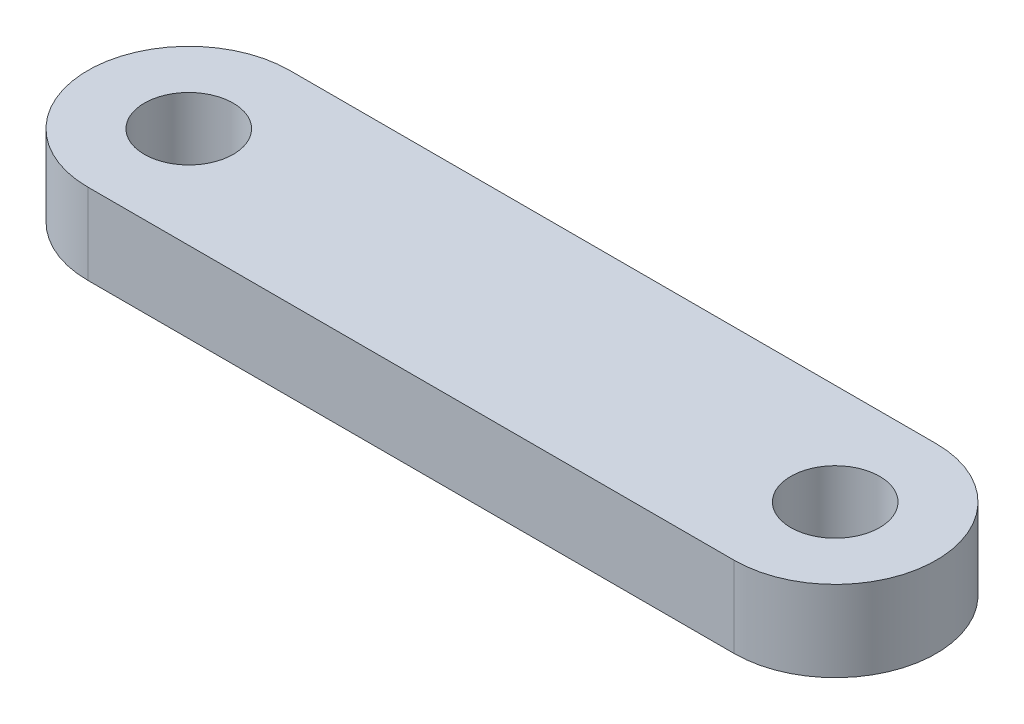
ISO-10303-21;
HEADER;
FILE_DESCRIPTION(('STEP AP214'),'2;1');
FILE_NAME('part.step','',(''),(''),'','','');
FILE_SCHEMA(('AUTOMOTIVE_DESIGN { 1 0 10303 214 1 1 1 1 }'));
ENDSEC;
DATA;
#1=APPLICATION_CONTEXT('core data for automotive mechanical design processes');
#2=APPLICATION_PROTOCOL_DEFINITION('international standard','automotive_design',2000,#1);
#3=PRODUCT_CONTEXT('',#1,'mechanical');
#4=PRODUCT('Part','Part','',(#3));
#5=PRODUCT_RELATED_PRODUCT_CATEGORY('part','',(#4));
#6=PRODUCT_DEFINITION_FORMATION('','',#4);
#7=PRODUCT_DEFINITION_CONTEXT('part definition',#1,'design');
#8=PRODUCT_DEFINITION('design','',#6,#7);
#9=PRODUCT_DEFINITION_SHAPE('','',#8);
#10=(LENGTH_UNIT() NAMED_UNIT(*) SI_UNIT(.MILLI.,.METRE.));
#11=(NAMED_UNIT(*) PLANE_ANGLE_UNIT() SI_UNIT($,.RADIAN.));
#12=(NAMED_UNIT(*) SI_UNIT($,.STERADIAN.) SOLID_ANGLE_UNIT());
#13=UNCERTAINTY_MEASURE_WITH_UNIT(LENGTH_MEASURE(1.E-05),#10,'distance_accuracy_value','');
#14=(GEOMETRIC_REPRESENTATION_CONTEXT(3) GLOBAL_UNCERTAINTY_ASSIGNED_CONTEXT((#13)) GLOBAL_UNIT_ASSIGNED_CONTEXT((#10,
#11,#12)) REPRESENTATION_CONTEXT('',''));
#15=CARTESIAN_POINT('',(0.,0.,0.));
#16=DIRECTION('',(0.,0.,1.));
#17=DIRECTION('',(1.,0.,0.));
#18=AXIS2_PLACEMENT_3D('',#15,#16,#17);
#19=CARTESIAN_POINT('',(0.,2.,0.));
#20=DIRECTION('',(0.,1.,0.));
#21=DIRECTION('',(0.,0.,1.));
#22=AXIS2_PLACEMENT_3D('',#19,#20,#21);
#23=PLANE('',#22);
#24=CARTESIAN_POINT('',(0.,2.,0.));
#25=DIRECTION('',(0.,1.,0.));
#26=DIRECTION('',(0.,0.,1.));
#27=AXIS2_PLACEMENT_3D('',#24,#25,#26);
#28=CIRCLE('',#27,1.1);
#29=CARTESIAN_POINT('',(0.,2.,1.1));
#30=VERTEX_POINT('',#29);
#31=EDGE_CURVE('E116',#30,#30,#28,.T.);
#32=ORIENTED_EDGE('',*,*,#31,.F.);
#33=EDGE_LOOP('',(#32));
#34=FACE_BOUND('',#33,.T.);
#35=CARTESIAN_POINT('',(0.,2.,0.));
#36=DIRECTION('',(0.,1.,0.));
#37=DIRECTION('',(0.,0.,1.));
#38=AXIS2_PLACEMENT_3D('',#35,#36,#37);
#39=CIRCLE('',#38,2.5);
#40=CARTESIAN_POINT('',(0.,2.,-2.5));
#41=VERTEX_POINT('',#40);
#42=CARTESIAN_POINT('',(0.,2.,2.5));
#43=VERTEX_POINT('',#42);
#44=EDGE_CURVE('E96',#41,#43,#39,.T.);
#45=ORIENTED_EDGE('',*,*,#44,.T.);
#46=DIRECTION('',(1.,0.,0.));
#47=VECTOR('',#46,1.);
#48=CARTESIAN_POINT('',(0.,2.,2.5));
#49=LINE('',#48,#47);
#50=CARTESIAN_POINT('',(16.,2.,2.5));
#51=VERTEX_POINT('',#50);
#52=EDGE_CURVE('E91',#43,#51,#49,.T.);
#53=ORIENTED_EDGE('',*,*,#52,.T.);
#54=CARTESIAN_POINT('',(16.,2.,0.));
#55=DIRECTION('',(0.,1.,0.));
#56=DIRECTION('',(0.,0.,1.));
#57=AXIS2_PLACEMENT_3D('',#54,#55,#56);
#58=CIRCLE('',#57,2.5);
#59=CARTESIAN_POINT('',(16.,2.,-2.5));
#60=VERTEX_POINT('',#59);
#61=EDGE_CURVE('E94',#51,#60,#58,.T.);
#62=ORIENTED_EDGE('',*,*,#61,.T.);
#63=DIRECTION('',(-1.,0.,0.));
#64=VECTOR('',#63,1.);
#65=CARTESIAN_POINT('',(0.,2.,-2.5));
#66=LINE('',#65,#64);
#67=EDGE_CURVE('E61',#60,#41,#66,.T.);
#68=ORIENTED_EDGE('',*,*,#67,.T.);
#69=EDGE_LOOP('',(#45,#53,#62,#68));
#70=FACE_BOUND('',#69,.T.);
#71=CARTESIAN_POINT('',(16.,2.,0.));
#72=DIRECTION('',(0.,1.,0.));
#73=DIRECTION('',(0.,0.,1.));
#74=AXIS2_PLACEMENT_3D('',#71,#72,#73);
#75=CIRCLE('',#74,1.1);
#76=CARTESIAN_POINT('',(16.,2.,1.1));
#77=VERTEX_POINT('',#76);
#78=EDGE_CURVE('E138',#77,#77,#75,.T.);
#79=ORIENTED_EDGE('',*,*,#78,.F.);
#80=EDGE_LOOP('',(#79));
#81=FACE_BOUND('',#80,.T.);
#82=ADVANCED_FACE('F43',(#34,#70,#81),#23,.T.);
#83=CARTESIAN_POINT('',(0.,0.,0.));
#84=DIRECTION('',(0.,1.,0.));
#85=DIRECTION('',(0.,0.,1.));
#86=AXIS2_PLACEMENT_3D('',#83,#84,#85);
#87=PLANE('',#86);
#88=CARTESIAN_POINT('',(0.,0.,0.));
#89=DIRECTION('',(0.,1.,0.));
#90=DIRECTION('',(0.,0.,1.));
#91=AXIS2_PLACEMENT_3D('',#88,#89,#90);
#92=CIRCLE('',#91,2.5);
#93=CARTESIAN_POINT('',(0.,0.,-2.5));
#94=VERTEX_POINT('',#93);
#95=CARTESIAN_POINT('',(0.,0.,2.5));
#96=VERTEX_POINT('',#95);
#97=EDGE_CURVE('E112',#94,#96,#92,.T.);
#98=ORIENTED_EDGE('',*,*,#97,.F.);
#99=DIRECTION('',(-1.,0.,0.));
#100=VECTOR('',#99,1.);
#101=CARTESIAN_POINT('',(0.,0.,-2.5));
#102=LINE('',#101,#100);
#103=CARTESIAN_POINT('',(16.,0.,-2.5));
#104=VERTEX_POINT('',#103);
#105=EDGE_CURVE('E84',#104,#94,#102,.T.);
#106=ORIENTED_EDGE('',*,*,#105,.F.);
#107=CARTESIAN_POINT('',(16.,0.,0.));
#108=DIRECTION('',(0.,1.,0.));
#109=DIRECTION('',(0.,0.,1.));
#110=AXIS2_PLACEMENT_3D('',#107,#108,#109);
#111=CIRCLE('',#110,2.5);
#112=CARTESIAN_POINT('',(16.,0.,2.5));
#113=VERTEX_POINT('',#112);
#114=EDGE_CURVE('E78',#113,#104,#111,.T.);
#115=ORIENTED_EDGE('',*,*,#114,.F.);
#116=DIRECTION('',(1.,0.,0.));
#117=VECTOR('',#116,1.);
#118=CARTESIAN_POINT('',(0.,0.,2.5));
#119=LINE('',#118,#117);
#120=EDGE_CURVE('E101',#96,#113,#119,.T.);
#121=ORIENTED_EDGE('',*,*,#120,.F.);
#122=EDGE_LOOP('',(#98,#106,#115,#121));
#123=FACE_BOUND('',#122,.T.);
#124=CARTESIAN_POINT('',(0.,0.,0.));
#125=DIRECTION('',(0.,1.,0.));
#126=DIRECTION('',(0.,0.,1.));
#127=AXIS2_PLACEMENT_3D('',#124,#125,#126);
#128=CIRCLE('',#127,1.1);
#129=CARTESIAN_POINT('',(0.,0.,1.1));
#130=VERTEX_POINT('',#129);
#131=EDGE_CURVE('E134',#130,#130,#128,.T.);
#132=ORIENTED_EDGE('',*,*,#131,.T.);
#133=EDGE_LOOP('',(#132));
#134=FACE_BOUND('',#133,.T.);
#135=CARTESIAN_POINT('',(16.,0.,0.));
#136=DIRECTION('',(0.,1.,0.));
#137=DIRECTION('',(0.,0.,1.));
#138=AXIS2_PLACEMENT_3D('',#135,#136,#137);
#139=CIRCLE('',#138,1.1);
#140=CARTESIAN_POINT('',(16.,0.,1.1));
#141=VERTEX_POINT('',#140);
#142=EDGE_CURVE('E142',#141,#141,#139,.T.);
#143=ORIENTED_EDGE('',*,*,#142,.T.);
#144=EDGE_LOOP('',(#143));
#145=FACE_BOUND('',#144,.T.);
#146=ADVANCED_FACE('F129',(#123,#134,#145),#87,.F.);
#147=CARTESIAN_POINT('',(0.,2.,0.));
#148=DIRECTION('',(0.,-1.,0.));
#149=DIRECTION('',(0.,0.,-1.));
#150=AXIS2_PLACEMENT_3D('',#147,#148,#149);
#151=CYLINDRICAL_SURFACE('',#150,2.5);
#152=ORIENTED_EDGE('',*,*,#97,.T.);
#153=DIRECTION('',(0.,-1.,0.));
#154=VECTOR('',#153,1.);
#155=CARTESIAN_POINT('',(0.,2.,2.5));
#156=LINE('',#155,#154);
#157=EDGE_CURVE('E11',#43,#96,#156,.T.);
#158=ORIENTED_EDGE('',*,*,#157,.F.);
#159=ORIENTED_EDGE('',*,*,#44,.F.);
#160=DIRECTION('',(0.,-1.,0.));
#161=VECTOR('',#160,1.);
#162=CARTESIAN_POINT('',(0.,2.,-2.5));
#163=LINE('',#162,#161);
#164=EDGE_CURVE('E108',#41,#94,#163,.T.);
#165=ORIENTED_EDGE('',*,*,#164,.T.);
#166=EDGE_LOOP('',(#152,#158,#159,#165));
#167=FACE_BOUND('',#166,.T.);
#168=ADVANCED_FACE('F45',(#167),#151,.T.);
#169=CARTESIAN_POINT('',(0.,2.,2.5));
#170=DIRECTION('',(0.,0.,-1.));
#171=DIRECTION('',(-1.,0.,0.));
#172=AXIS2_PLACEMENT_3D('',#169,#170,#171);
#173=PLANE('',#172);
#174=ORIENTED_EDGE('',*,*,#120,.T.);
#175=DIRECTION('',(0.,-1.,0.));
#176=VECTOR('',#175,1.);
#177=CARTESIAN_POINT('',(16.,2.,2.5));
#178=LINE('',#177,#176);
#179=EDGE_CURVE('E53',#51,#113,#178,.T.);
#180=ORIENTED_EDGE('',*,*,#179,.F.);
#181=ORIENTED_EDGE('',*,*,#52,.F.);
#182=ORIENTED_EDGE('',*,*,#157,.T.);
#183=EDGE_LOOP('',(#174,#180,#181,#182));
#184=FACE_BOUND('',#183,.T.);
#185=ADVANCED_FACE('F100',(#184),#173,.F.);
#186=CARTESIAN_POINT('',(16.,2.,0.));
#187=DIRECTION('',(0.,-1.,0.));
#188=DIRECTION('',(0.,0.,-1.));
#189=AXIS2_PLACEMENT_3D('',#186,#187,#188);
#190=CYLINDRICAL_SURFACE('',#189,2.5);
#191=ORIENTED_EDGE('',*,*,#114,.T.);
#192=DIRECTION('',(0.,-1.,0.));
#193=VECTOR('',#192,1.);
#194=CARTESIAN_POINT('',(16.,2.,-2.5));
#195=LINE('',#194,#193);
#196=EDGE_CURVE('E103',#60,#104,#195,.T.);
#197=ORIENTED_EDGE('',*,*,#196,.F.);
#198=ORIENTED_EDGE('',*,*,#61,.F.);
#199=ORIENTED_EDGE('',*,*,#179,.T.);
#200=EDGE_LOOP('',(#191,#197,#198,#199));
#201=FACE_BOUND('',#200,.T.);
#202=ADVANCED_FACE('F104',(#201),#190,.T.);
#203=CARTESIAN_POINT('',(0.,2.,-2.5));
#204=DIRECTION('',(0.,0.,1.));
#205=DIRECTION('',(1.,0.,0.));
#206=AXIS2_PLACEMENT_3D('',#203,#204,#205);
#207=PLANE('',#206);
#208=ORIENTED_EDGE('',*,*,#105,.T.);
#209=ORIENTED_EDGE('',*,*,#164,.F.);
#210=ORIENTED_EDGE('',*,*,#67,.F.);
#211=ORIENTED_EDGE('',*,*,#196,.T.);
#212=EDGE_LOOP('',(#208,#209,#210,#211));
#213=FACE_BOUND('',#212,.T.);
#214=ADVANCED_FACE('F126',(#213),#207,.F.);
#215=CARTESIAN_POINT('',(0.,2.,0.));
#216=DIRECTION('',(0.,-1.,0.));
#217=DIRECTION('',(0.,0.,-1.));
#218=AXIS2_PLACEMENT_3D('',#215,#216,#217);
#219=CYLINDRICAL_SURFACE('',#218,1.1);
#220=ORIENTED_EDGE('',*,*,#31,.T.);
#221=EDGE_LOOP('',(#220));
#222=FACE_BOUND('',#221,.T.);
#223=ORIENTED_EDGE('',*,*,#131,.F.);
#224=EDGE_LOOP('',(#223));
#225=FACE_BOUND('',#224,.T.);
#226=ADVANCED_FACE('F161',(#222,#225),#219,.F.);
#227=CARTESIAN_POINT('',(16.,2.,0.));
#228=DIRECTION('',(0.,-1.,0.));
#229=DIRECTION('',(0.,0.,-1.));
#230=AXIS2_PLACEMENT_3D('',#227,#228,#229);
#231=CYLINDRICAL_SURFACE('',#230,1.1);
#232=ORIENTED_EDGE('',*,*,#78,.T.);
#233=EDGE_LOOP('',(#232));
#234=FACE_BOUND('',#233,.T.);
#235=ORIENTED_EDGE('',*,*,#142,.F.);
#236=EDGE_LOOP('',(#235));
#237=FACE_BOUND('',#236,.T.);
#238=ADVANCED_FACE('F150',(#234,#237),#231,.F.);
#239=CLOSED_SHELL('',(#82,#146,#168,#185,#202,#214,#226,#238));
#240=MANIFOLD_SOLID_BREP('B2',#239);
#241=ADVANCED_BREP_SHAPE_REPRESENTATION('',(#18,#240),#14);
#242=SHAPE_DEFINITION_REPRESENTATION(#9,#241);
ENDSEC;
END-ISO-10303-21;
